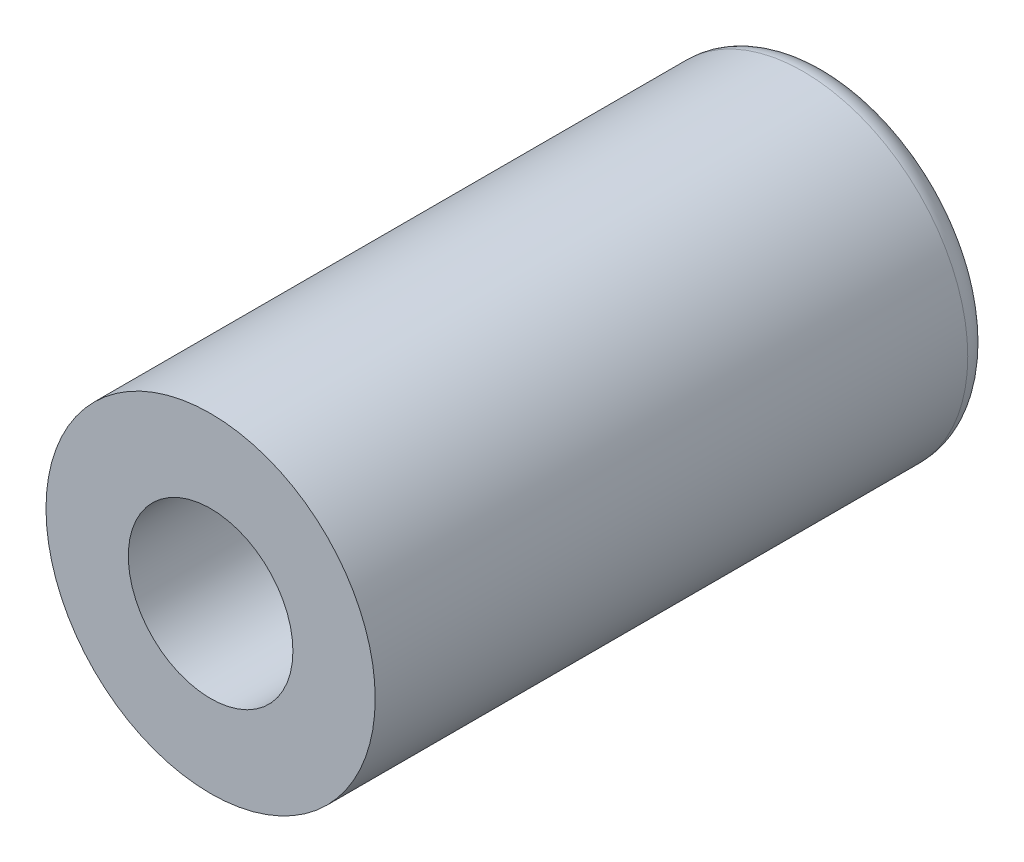
ISO-10303-21;
HEADER;
FILE_DESCRIPTION(('STEP AP214'),'2;1');
FILE_NAME('part.step','',(''),(''),'','','');
FILE_SCHEMA(('AUTOMOTIVE_DESIGN { 1 0 10303 214 1 1 1 1 }'));
ENDSEC;
DATA;
#1=APPLICATION_CONTEXT('core data for automotive mechanical design processes');
#2=APPLICATION_PROTOCOL_DEFINITION('international standard','automotive_design',2000,#1);
#3=PRODUCT_CONTEXT('',#1,'mechanical');
#4=PRODUCT('Part','Part','',(#3));
#5=PRODUCT_RELATED_PRODUCT_CATEGORY('part','',(#4));
#6=PRODUCT_DEFINITION_FORMATION('','',#4);
#7=PRODUCT_DEFINITION_CONTEXT('part definition',#1,'design');
#8=PRODUCT_DEFINITION('design','',#6,#7);
#9=PRODUCT_DEFINITION_SHAPE('','',#8);
#10=(LENGTH_UNIT() NAMED_UNIT(*) SI_UNIT(.MILLI.,.METRE.));
#11=(NAMED_UNIT(*) PLANE_ANGLE_UNIT() SI_UNIT($,.RADIAN.));
#12=(NAMED_UNIT(*) SI_UNIT($,.STERADIAN.) SOLID_ANGLE_UNIT());
#13=UNCERTAINTY_MEASURE_WITH_UNIT(LENGTH_MEASURE(1.E-05),#10,'distance_accuracy_value','');
#14=(GEOMETRIC_REPRESENTATION_CONTEXT(3) GLOBAL_UNCERTAINTY_ASSIGNED_CONTEXT((#13)) GLOBAL_UNIT_ASSIGNED_CONTEXT((#10,
#11,#12)) REPRESENTATION_CONTEXT('',''));
#15=CARTESIAN_POINT('',(0.,0.,0.));
#16=DIRECTION('',(0.,0.,1.));
#17=DIRECTION('',(1.,0.,0.));
#18=AXIS2_PLACEMENT_3D('',#15,#16,#17);
#19=CARTESIAN_POINT('',(0.,0.,15.));
#20=DIRECTION('',(0.,0.,-1.));
#21=DIRECTION('',(-1.,0.,0.));
#22=AXIS2_PLACEMENT_3D('',#19,#20,#21);
#23=CYLINDRICAL_SURFACE('',#22,4.);
#24=CARTESIAN_POINT('',(0.,0.,0.6));
#25=DIRECTION('',(0.,0.,1.));
#26=DIRECTION('',(1.,0.,0.));
#27=AXIS2_PLACEMENT_3D('',#24,#25,#26);
#28=CIRCLE('',#27,4.);
#29=CARTESIAN_POINT('',(4.,0.,0.6));
#30=VERTEX_POINT('',#29);
#31=EDGE_CURVE('E39',#30,#30,#28,.T.);
#32=ORIENTED_EDGE('',*,*,#31,.T.);
#33=EDGE_LOOP('',(#32));
#34=FACE_BOUND('',#33,.T.);
#35=CARTESIAN_POINT('',(0.,0.,15.));
#36=DIRECTION('',(0.,0.,1.));
#37=DIRECTION('',(1.,0.,0.));
#38=AXIS2_PLACEMENT_3D('',#35,#36,#37);
#39=CIRCLE('',#38,4.);
#40=CARTESIAN_POINT('',(4.,0.,15.));
#41=VERTEX_POINT('',#40);
#42=EDGE_CURVE('E43',#41,#41,#39,.T.);
#43=ORIENTED_EDGE('',*,*,#42,.F.);
#44=EDGE_LOOP('',(#43));
#45=FACE_BOUND('',#44,.T.);
#46=ADVANCED_FACE('F32',(#34,#45),#23,.T.);
#47=CARTESIAN_POINT('',(0.,0.,15.));
#48=DIRECTION('',(0.,0.,1.));
#49=DIRECTION('',(1.,0.,0.));
#50=AXIS2_PLACEMENT_3D('',#47,#48,#49);
#51=PLANE('',#50);
#52=CARTESIAN_POINT('',(0.,0.,15.));
#53=DIRECTION('',(0.,0.,1.));
#54=DIRECTION('',(1.,0.,0.));
#55=AXIS2_PLACEMENT_3D('',#52,#53,#54);
#56=CIRCLE('',#55,2.);
#57=CARTESIAN_POINT('',(2.,0.,15.));
#58=VERTEX_POINT('',#57);
#59=EDGE_CURVE('E52',#58,#58,#56,.T.);
#60=ORIENTED_EDGE('',*,*,#59,.F.);
#61=EDGE_LOOP('',(#60));
#62=FACE_BOUND('',#61,.T.);
#63=ORIENTED_EDGE('',*,*,#42,.T.);
#64=EDGE_LOOP('',(#63));
#65=FACE_BOUND('',#64,.T.);
#66=ADVANCED_FACE('F58',(#62,#65),#51,.T.);
#67=CARTESIAN_POINT('',(0.,0.,0.));
#68=DIRECTION('',(0.,0.,1.));
#69=DIRECTION('',(1.,0.,0.));
#70=AXIS2_PLACEMENT_3D('',#67,#68,#69);
#71=PLANE('',#70);
#72=CARTESIAN_POINT('',(0.,0.,0.));
#73=DIRECTION('',(0.,0.,1.));
#74=DIRECTION('',(1.,0.,0.));
#75=AXIS2_PLACEMENT_3D('',#72,#73,#74);
#76=CIRCLE('',#75,3.4);
#77=CARTESIAN_POINT('',(3.4,0.,0.));
#78=VERTEX_POINT('',#77);
#79=EDGE_CURVE('E11',#78,#78,#76,.F.);
#80=ORIENTED_EDGE('',*,*,#79,.T.);
#81=EDGE_LOOP('',(#80));
#82=FACE_BOUND('',#81,.T.);
#83=ADVANCED_FACE('F61',(#82),#71,.F.);
#84=CARTESIAN_POINT('',(0.,0.,-5.65685424949238));
#85=DIRECTION('',(0.,0.,1.));
#86=DIRECTION('',(1.,0.,0.));
#87=AXIS2_PLACEMENT_3D('',#84,#85,#86);
#88=CYLINDRICAL_SURFACE('',#87,2.);
#89=CARTESIAN_POINT('',(0.,0.,2.));
#90=DIRECTION('',(0.,0.,1.));
#91=DIRECTION('',(1.,0.,0.));
#92=AXIS2_PLACEMENT_3D('',#89,#90,#91);
#93=CIRCLE('',#92,2.);
#94=CARTESIAN_POINT('',(2.,0.,2.));
#95=VERTEX_POINT('',#94);
#96=EDGE_CURVE('E47',#95,#95,#93,.F.);
#97=ORIENTED_EDGE('',*,*,#96,.T.);
#98=EDGE_LOOP('',(#97));
#99=FACE_BOUND('',#98,.T.);
#100=ORIENTED_EDGE('',*,*,#59,.T.);
#101=EDGE_LOOP('',(#100));
#102=FACE_BOUND('',#101,.T.);
#103=ADVANCED_FACE('F56',(#99,#102),#88,.F.);
#104=CARTESIAN_POINT('',(0.,0.,2.));
#105=DIRECTION('',(0.,0.,1.));
#106=DIRECTION('',(1.,0.,0.));
#107=AXIS2_PLACEMENT_3D('',#104,#105,#106);
#108=PLANE('',#107);
#109=ORIENTED_EDGE('',*,*,#96,.F.);
#110=EDGE_LOOP('',(#109));
#111=FACE_BOUND('',#110,.T.);
#112=ADVANCED_FACE('F73',(#111),#108,.T.);
#113=CARTESIAN_POINT('',(0.,0.,0.6));
#114=DIRECTION('',(0.,0.,1.));
#115=DIRECTION('',(1.,0.,0.));
#116=AXIS2_PLACEMENT_3D('',#113,#114,#115);
#117=TOROIDAL_SURFACE('',#116,3.4,0.6);
#118=ORIENTED_EDGE('',*,*,#79,.F.);
#119=EDGE_LOOP('',(#118));
#120=FACE_BOUND('',#119,.T.);
#121=ORIENTED_EDGE('',*,*,#31,.F.);
#122=EDGE_LOOP('',(#121));
#123=FACE_BOUND('',#122,.T.);
#124=ADVANCED_FACE('F34',(#120,#123),#117,.T.);
#125=CLOSED_SHELL('',(#46,#66,#83,#103,#112,#124));
#126=MANIFOLD_SOLID_BREP('B2',#125);
#127=ADVANCED_BREP_SHAPE_REPRESENTATION('',(#18,#126),#14);
#128=SHAPE_DEFINITION_REPRESENTATION(#9,#127);
ENDSEC;
END-ISO-10303-21;
